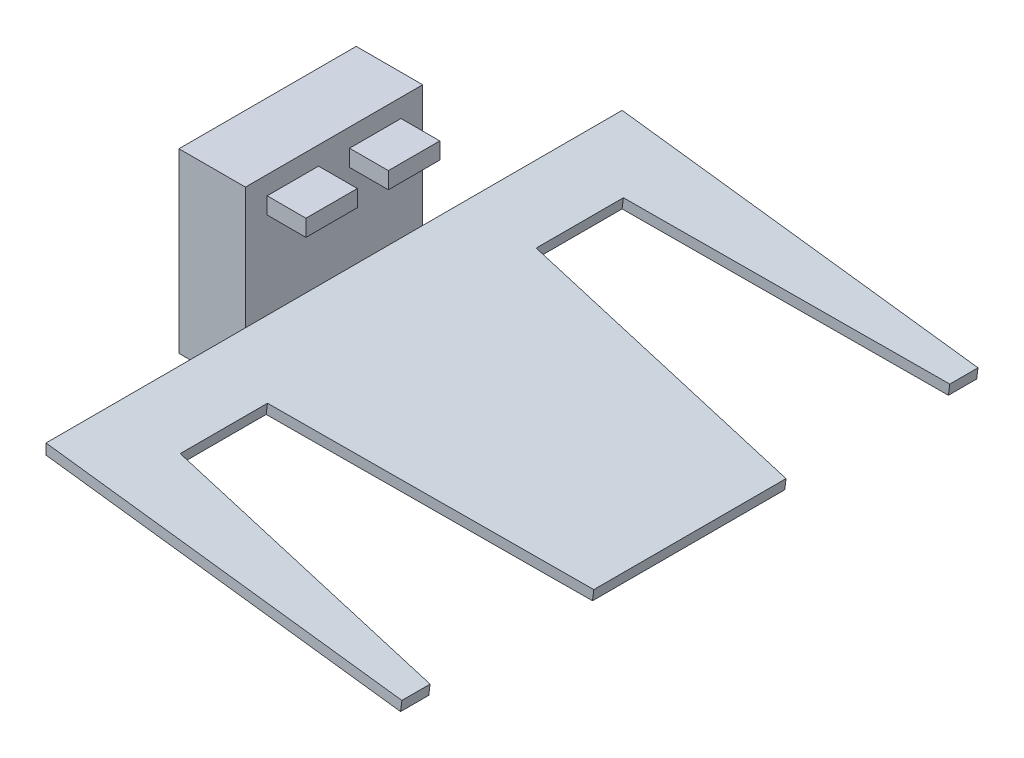
ISO-10303-21;
HEADER;
FILE_DESCRIPTION(('STEP AP214'),'2;1');
FILE_NAME('part.step','',(''),(''),'','','');
FILE_SCHEMA(('AUTOMOTIVE_DESIGN { 1 0 10303 214 1 1 1 1 }'));
ENDSEC;
DATA;
#1=APPLICATION_CONTEXT('core data for automotive mechanical design processes');
#2=APPLICATION_PROTOCOL_DEFINITION('international standard','automotive_design',2000,#1);
#3=PRODUCT_CONTEXT('',#1,'mechanical');
#4=PRODUCT('Part','Part','',(#3));
#5=PRODUCT_RELATED_PRODUCT_CATEGORY('part','',(#4));
#6=PRODUCT_DEFINITION_FORMATION('','',#4);
#7=PRODUCT_DEFINITION_CONTEXT('part definition',#1,'design');
#8=PRODUCT_DEFINITION('design','',#6,#7);
#9=PRODUCT_DEFINITION_SHAPE('','',#8);
#10=(LENGTH_UNIT() NAMED_UNIT(*) SI_UNIT(.MILLI.,.METRE.));
#11=(NAMED_UNIT(*) PLANE_ANGLE_UNIT() SI_UNIT($,.RADIAN.));
#12=(NAMED_UNIT(*) SI_UNIT($,.STERADIAN.) SOLID_ANGLE_UNIT());
#13=UNCERTAINTY_MEASURE_WITH_UNIT(LENGTH_MEASURE(1.E-05),#10,'distance_accuracy_value','');
#14=(GEOMETRIC_REPRESENTATION_CONTEXT(3) GLOBAL_UNCERTAINTY_ASSIGNED_CONTEXT((#13)) GLOBAL_UNIT_ASSIGNED_CONTEXT((#10,
#11,#12)) REPRESENTATION_CONTEXT('',''));
#15=CARTESIAN_POINT('',(0.,0.,0.));
#16=DIRECTION('',(0.,0.,1.));
#17=DIRECTION('',(1.,0.,0.));
#18=AXIS2_PLACEMENT_3D('',#15,#16,#17);
#19=CARTESIAN_POINT('',(20.6375,45.5277500044092,-19.177));
#20=DIRECTION('',(0.,-1.,0.));
#21=DIRECTION('',(0.,0.,-1.));
#22=AXIS2_PLACEMENT_3D('',#19,#20,#21);
#23=PLANE('',#22);
#24=DIRECTION('',(0.,0.,1.));
#25=VECTOR('',#24,1.);
#26=CARTESIAN_POINT('',(9.525,45.5277500044092,-19.177));
#27=LINE('',#26,#25);
#28=CARTESIAN_POINT('',(9.525,45.5277500044092,-19.177));
#29=VERTEX_POINT('',#28);
#30=CARTESIAN_POINT('',(9.525,45.5277500044092,-4.445));
#31=VERTEX_POINT('',#30);
#32=EDGE_CURVE('E105',#29,#31,#27,.T.);
#33=ORIENTED_EDGE('',*,*,#32,.T.);
#34=DIRECTION('',(-1.,0.,0.));
#35=VECTOR('',#34,1.);
#36=CARTESIAN_POINT('',(20.6375,45.5277500044092,-4.445));
#37=LINE('',#36,#35);
#38=CARTESIAN_POINT('',(20.6375,45.5277500044092,-4.445));
#39=VERTEX_POINT('',#38);
#40=EDGE_CURVE('E12',#39,#31,#37,.T.);
#41=ORIENTED_EDGE('',*,*,#40,.F.);
#42=DIRECTION('',(0.,0.,1.));
#43=VECTOR('',#42,1.);
#44=CARTESIAN_POINT('',(20.6375,45.5277500044092,-19.177));
#45=LINE('',#44,#43);
#46=CARTESIAN_POINT('',(20.6375,45.5277500044092,-19.177));
#47=VERTEX_POINT('',#46);
#48=EDGE_CURVE('E93',#47,#39,#45,.T.);
#49=ORIENTED_EDGE('',*,*,#48,.F.);
#50=DIRECTION('',(-1.,0.,0.));
#51=VECTOR('',#50,1.);
#52=CARTESIAN_POINT('',(20.6375,45.5277500044092,-19.177));
#53=LINE('',#52,#51);
#54=EDGE_CURVE('E101',#47,#29,#53,.T.);
#55=ORIENTED_EDGE('',*,*,#54,.T.);
#56=EDGE_LOOP('',(#33,#41,#49,#55));
#57=FACE_BOUND('',#56,.T.);
#58=ADVANCED_FACE('F42',(#57),#23,.F.);
#59=CARTESIAN_POINT('',(20.6375,45.5277500044092,-4.445));
#60=DIRECTION('',(0.,0.,-1.));
#61=DIRECTION('',(0.,1.,0.));
#62=AXIS2_PLACEMENT_3D('',#59,#60,#61);
#63=PLANE('',#62);
#64=DIRECTION('',(0.,-1.,0.));
#65=VECTOR('',#64,1.);
#66=CARTESIAN_POINT('',(9.525,45.5277500044092,-4.445));
#67=LINE('',#66,#65);
#68=CARTESIAN_POINT('',(9.525,40.7652500044092,-4.445));
#69=VERTEX_POINT('',#68);
#70=EDGE_CURVE('E97',#31,#69,#67,.T.);
#71=ORIENTED_EDGE('',*,*,#70,.T.);
#72=DIRECTION('',(-1.,0.,0.));
#73=VECTOR('',#72,1.);
#74=CARTESIAN_POINT('',(20.6375,40.7652500044092,-4.445));
#75=LINE('',#74,#73);
#76=CARTESIAN_POINT('',(20.6375,40.7652500044092,-4.445));
#77=VERTEX_POINT('',#76);
#78=EDGE_CURVE('E50',#77,#69,#75,.T.);
#79=ORIENTED_EDGE('',*,*,#78,.F.);
#80=DIRECTION('',(0.,-1.,0.));
#81=VECTOR('',#80,1.);
#82=CARTESIAN_POINT('',(20.6375,45.5277500044092,-4.445));
#83=LINE('',#82,#81);
#84=EDGE_CURVE('E88',#39,#77,#83,.T.);
#85=ORIENTED_EDGE('',*,*,#84,.F.);
#86=ORIENTED_EDGE('',*,*,#40,.T.);
#87=EDGE_LOOP('',(#71,#79,#85,#86));
#88=FACE_BOUND('',#87,.T.);
#89=ADVANCED_FACE('F96',(#88),#63,.F.);
#90=CARTESIAN_POINT('',(20.6375,40.7652500044092,-19.177));
#91=DIRECTION('',(0.,1.,0.));
#92=DIRECTION('',(0.,0.,1.));
#93=AXIS2_PLACEMENT_3D('',#90,#91,#92);
#94=PLANE('',#93);
#95=DIRECTION('',(0.,0.,-1.));
#96=VECTOR('',#95,1.);
#97=CARTESIAN_POINT('',(9.525,40.7652500044092,-19.177));
#98=LINE('',#97,#96);
#99=CARTESIAN_POINT('',(9.525,40.7652500044092,-19.177));
#100=VERTEX_POINT('',#99);
#101=EDGE_CURVE('E75',#69,#100,#98,.T.);
#102=ORIENTED_EDGE('',*,*,#101,.T.);
#103=DIRECTION('',(-1.,0.,0.));
#104=VECTOR('',#103,1.);
#105=CARTESIAN_POINT('',(20.6375,40.7652500044092,-19.177));
#106=LINE('',#105,#104);
#107=CARTESIAN_POINT('',(20.6375,40.7652500044092,-19.177));
#108=VERTEX_POINT('',#107);
#109=EDGE_CURVE('E98',#108,#100,#106,.T.);
#110=ORIENTED_EDGE('',*,*,#109,.F.);
#111=DIRECTION('',(0.,0.,-1.));
#112=VECTOR('',#111,1.);
#113=CARTESIAN_POINT('',(20.6375,40.7652500044092,-19.177));
#114=LINE('',#113,#112);
#115=EDGE_CURVE('E91',#77,#108,#114,.T.);
#116=ORIENTED_EDGE('',*,*,#115,.F.);
#117=ORIENTED_EDGE('',*,*,#78,.T.);
#118=EDGE_LOOP('',(#102,#110,#116,#117));
#119=FACE_BOUND('',#118,.T.);
#120=ADVANCED_FACE('F99',(#119),#94,.F.);
#121=CARTESIAN_POINT('',(20.6375,45.5277500044092,-19.177));
#122=DIRECTION('',(0.,0.,1.));
#123=DIRECTION('',(1.,0.,0.));
#124=AXIS2_PLACEMENT_3D('',#121,#122,#123);
#125=PLANE('',#124);
#126=DIRECTION('',(0.,1.,0.));
#127=VECTOR('',#126,1.);
#128=CARTESIAN_POINT('',(9.525,45.5277500044092,-19.177));
#129=LINE('',#128,#127);
#130=EDGE_CURVE('E81',#100,#29,#129,.T.);
#131=ORIENTED_EDGE('',*,*,#130,.T.);
#132=ORIENTED_EDGE('',*,*,#54,.F.);
#133=DIRECTION('',(0.,1.,0.));
#134=VECTOR('',#133,1.);
#135=CARTESIAN_POINT('',(20.6375,45.5277500044092,-19.177));
#136=LINE('',#135,#134);
#137=EDGE_CURVE('E58',#108,#47,#136,.T.);
#138=ORIENTED_EDGE('',*,*,#137,.F.);
#139=ORIENTED_EDGE('',*,*,#109,.T.);
#140=EDGE_LOOP('',(#131,#132,#138,#139));
#141=FACE_BOUND('',#140,.T.);
#142=ADVANCED_FACE('F112',(#141),#125,.F.);
#143=CARTESIAN_POINT('',(20.6375,45.5277500044092,-4.445));
#144=DIRECTION('',(1.,0.,0.));
#145=DIRECTION('',(0.,0.,-1.));
#146=AXIS2_PLACEMENT_3D('',#143,#144,#145);
#147=PLANE('',#146);
#148=ORIENTED_EDGE('',*,*,#48,.T.);
#149=ORIENTED_EDGE('',*,*,#84,.T.);
#150=ORIENTED_EDGE('',*,*,#115,.T.);
#151=ORIENTED_EDGE('',*,*,#137,.T.);
#152=EDGE_LOOP('',(#148,#149,#150,#151));
#153=FACE_BOUND('',#152,.T.);
#154=ADVANCED_FACE('F89',(#153),#147,.T.);
#155=CARTESIAN_POINT('',(9.525,45.5277500044092,-4.445));
#156=DIRECTION('',(1.,0.,0.));
#157=DIRECTION('',(0.,0.,-1.));
#158=AXIS2_PLACEMENT_3D('',#155,#156,#157);
#159=PLANE('',#158);
#160=ORIENTED_EDGE('',*,*,#32,.F.);
#161=ORIENTED_EDGE('',*,*,#130,.F.);
#162=ORIENTED_EDGE('',*,*,#101,.F.);
#163=ORIENTED_EDGE('',*,*,#70,.F.);
#164=EDGE_LOOP('',(#160,#161,#162,#163));
#165=FACE_BOUND('',#164,.T.);
#166=ADVANCED_FACE('F115',(#165),#159,.F.);
#167=CLOSED_SHELL('',(#58,#89,#120,#142,#154,#166));
#168=MANIFOLD_SOLID_BREP('B2',#167);
#169=CARTESIAN_POINT('',(20.6375,45.5277500044092,19.177));
#170=DIRECTION('',(0.,0.,-1.));
#171=DIRECTION('',(-1.,0.,0.));
#172=AXIS2_PLACEMENT_3D('',#169,#170,#171);
#173=PLANE('',#172);
#174=DIRECTION('',(0.,-1.,0.));
#175=VECTOR('',#174,1.);
#176=CARTESIAN_POINT('',(9.525,45.5277500044092,19.177));
#177=LINE('',#176,#175);
#178=CARTESIAN_POINT('',(9.525,45.5277500044092,19.177));
#179=VERTEX_POINT('',#178);
#180=CARTESIAN_POINT('',(9.525,40.7652500044092,19.177));
#181=VERTEX_POINT('',#180);
#182=EDGE_CURVE('E239',#179,#181,#177,.T.);
#183=ORIENTED_EDGE('',*,*,#182,.T.);
#184=DIRECTION('',(-1.,0.,0.));
#185=VECTOR('',#184,1.);
#186=CARTESIAN_POINT('',(20.6375,40.7652500044092,19.177));
#187=LINE('',#186,#185);
#188=CARTESIAN_POINT('',(20.6375,40.7652500044092,19.177));
#189=VERTEX_POINT('',#188);
#190=EDGE_CURVE('E40',#189,#181,#187,.T.);
#191=ORIENTED_EDGE('',*,*,#190,.F.);
#192=DIRECTION('',(0.,-1.,0.));
#193=VECTOR('',#192,1.);
#194=CARTESIAN_POINT('',(20.6375,45.5277500044092,19.177));
#195=LINE('',#194,#193);
#196=CARTESIAN_POINT('',(20.6375,45.5277500044092,19.177));
#197=VERTEX_POINT('',#196);
#198=EDGE_CURVE('E227',#197,#189,#195,.T.);
#199=ORIENTED_EDGE('',*,*,#198,.F.);
#200=DIRECTION('',(-1.,0.,0.));
#201=VECTOR('',#200,1.);
#202=CARTESIAN_POINT('',(20.6375,45.5277500044092,19.177));
#203=LINE('',#202,#201);
#204=EDGE_CURVE('E235',#197,#179,#203,.T.);
#205=ORIENTED_EDGE('',*,*,#204,.T.);
#206=EDGE_LOOP('',(#183,#191,#199,#205));
#207=FACE_BOUND('',#206,.T.);
#208=ADVANCED_FACE('F176',(#207),#173,.F.);
#209=CARTESIAN_POINT('',(20.6375,40.7652500044092,19.177));
#210=DIRECTION('',(0.,1.,0.));
#211=DIRECTION('',(-1.,0.,0.));
#212=AXIS2_PLACEMENT_3D('',#209,#210,#211);
#213=PLANE('',#212);
#214=DIRECTION('',(0.,0.,-1.));
#215=VECTOR('',#214,1.);
#216=CARTESIAN_POINT('',(9.525,40.7652500044092,19.177));
#217=LINE('',#216,#215);
#218=CARTESIAN_POINT('',(9.525,40.7652500044092,4.445));
#219=VERTEX_POINT('',#218);
#220=EDGE_CURVE('E231',#181,#219,#217,.T.);
#221=ORIENTED_EDGE('',*,*,#220,.T.);
#222=DIRECTION('',(-1.,0.,0.));
#223=VECTOR('',#222,1.);
#224=CARTESIAN_POINT('',(20.6375,40.7652500044092,4.445));
#225=LINE('',#224,#223);
#226=CARTESIAN_POINT('',(20.6375,40.7652500044092,4.445));
#227=VERTEX_POINT('',#226);
#228=EDGE_CURVE('E184',#227,#219,#225,.T.);
#229=ORIENTED_EDGE('',*,*,#228,.F.);
#230=DIRECTION('',(0.,0.,-1.));
#231=VECTOR('',#230,1.);
#232=CARTESIAN_POINT('',(20.6375,40.7652500044092,19.177));
#233=LINE('',#232,#231);
#234=EDGE_CURVE('E222',#189,#227,#233,.T.);
#235=ORIENTED_EDGE('',*,*,#234,.F.);
#236=ORIENTED_EDGE('',*,*,#190,.T.);
#237=EDGE_LOOP('',(#221,#229,#235,#236));
#238=FACE_BOUND('',#237,.T.);
#239=ADVANCED_FACE('F230',(#238),#213,.F.);
#240=CARTESIAN_POINT('',(20.6375,45.5277500044092,4.445));
#241=DIRECTION('',(0.,0.,1.));
#242=DIRECTION('',(0.,-1.,0.));
#243=AXIS2_PLACEMENT_3D('',#240,#241,#242);
#244=PLANE('',#243);
#245=DIRECTION('',(0.,1.,0.));
#246=VECTOR('',#245,1.);
#247=CARTESIAN_POINT('',(9.525,45.5277500044092,4.445));
#248=LINE('',#247,#246);
#249=CARTESIAN_POINT('',(9.525,45.5277500044092,4.445));
#250=VERTEX_POINT('',#249);
#251=EDGE_CURVE('E209',#219,#250,#248,.T.);
#252=ORIENTED_EDGE('',*,*,#251,.T.);
#253=DIRECTION('',(-1.,0.,0.));
#254=VECTOR('',#253,1.);
#255=CARTESIAN_POINT('',(20.6375,45.5277500044092,4.445));
#256=LINE('',#255,#254);
#257=CARTESIAN_POINT('',(20.6375,45.5277500044092,4.445));
#258=VERTEX_POINT('',#257);
#259=EDGE_CURVE('E232',#258,#250,#256,.T.);
#260=ORIENTED_EDGE('',*,*,#259,.F.);
#261=DIRECTION('',(0.,1.,0.));
#262=VECTOR('',#261,1.);
#263=CARTESIAN_POINT('',(20.6375,45.5277500044092,4.445));
#264=LINE('',#263,#262);
#265=EDGE_CURVE('E225',#227,#258,#264,.T.);
#266=ORIENTED_EDGE('',*,*,#265,.F.);
#267=ORIENTED_EDGE('',*,*,#228,.T.);
#268=EDGE_LOOP('',(#252,#260,#266,#267));
#269=FACE_BOUND('',#268,.T.);
#270=ADVANCED_FACE('F233',(#269),#244,.F.);
#271=CARTESIAN_POINT('',(20.6375,45.5277500044092,19.177));
#272=DIRECTION('',(0.,-1.,0.));
#273=DIRECTION('',(1.,0.,0.));
#274=AXIS2_PLACEMENT_3D('',#271,#272,#273);
#275=PLANE('',#274);
#276=DIRECTION('',(0.,0.,1.));
#277=VECTOR('',#276,1.);
#278=CARTESIAN_POINT('',(9.525,45.5277500044092,19.177));
#279=LINE('',#278,#277);
#280=EDGE_CURVE('E215',#250,#179,#279,.T.);
#281=ORIENTED_EDGE('',*,*,#280,.T.);
#282=ORIENTED_EDGE('',*,*,#204,.F.);
#283=DIRECTION('',(0.,0.,1.));
#284=VECTOR('',#283,1.);
#285=CARTESIAN_POINT('',(20.6375,45.5277500044092,19.177));
#286=LINE('',#285,#284);
#287=EDGE_CURVE('E192',#258,#197,#286,.T.);
#288=ORIENTED_EDGE('',*,*,#287,.F.);
#289=ORIENTED_EDGE('',*,*,#259,.T.);
#290=EDGE_LOOP('',(#281,#282,#288,#289));
#291=FACE_BOUND('',#290,.T.);
#292=ADVANCED_FACE('F246',(#291),#275,.F.);
#293=CARTESIAN_POINT('',(20.6375,40.7652500044092,19.177));
#294=DIRECTION('',(1.,0.,0.));
#295=DIRECTION('',(0.,0.,-1.));
#296=AXIS2_PLACEMENT_3D('',#293,#294,#295);
#297=PLANE('',#296);
#298=ORIENTED_EDGE('',*,*,#198,.T.);
#299=ORIENTED_EDGE('',*,*,#234,.T.);
#300=ORIENTED_EDGE('',*,*,#265,.T.);
#301=ORIENTED_EDGE('',*,*,#287,.T.);
#302=EDGE_LOOP('',(#298,#299,#300,#301));
#303=FACE_BOUND('',#302,.T.);
#304=ADVANCED_FACE('F223',(#303),#297,.T.);
#305=CARTESIAN_POINT('',(9.525,40.7652500044092,19.177));
#306=DIRECTION('',(1.,0.,0.));
#307=DIRECTION('',(0.,0.,-1.));
#308=AXIS2_PLACEMENT_3D('',#305,#306,#307);
#309=PLANE('',#308);
#310=ORIENTED_EDGE('',*,*,#182,.F.);
#311=ORIENTED_EDGE('',*,*,#280,.F.);
#312=ORIENTED_EDGE('',*,*,#251,.F.);
#313=ORIENTED_EDGE('',*,*,#220,.F.);
#314=EDGE_LOOP('',(#310,#311,#312,#313));
#315=FACE_BOUND('',#314,.T.);
#316=ADVANCED_FACE('F249',(#315),#309,.F.);
#317=CLOSED_SHELL('',(#208,#239,#270,#292,#304,#316));
#318=MANIFOLD_SOLID_BREP('B6',#317);
#319=CARTESIAN_POINT('',(111.125,0.,82.55));
#320=DIRECTION('',(-0.992091804885704,0.125514344513393,0.));
#321=DIRECTION('',(-0.125514344513393,-0.992091804885704,0.));
#322=AXIS2_PLACEMENT_3D('',#319,#320,#321);
#323=PLANE('',#322);
#324=DIRECTION('',(0.,0.,-1.));
#325=VECTOR('',#324,1.);
#326=CARTESIAN_POINT('',(111.501191593376,2.97349755760343,82.55));
#327=LINE('',#326,#325);
#328=CARTESIAN_POINT('',(111.501191593376,2.97349755760344,27.543705698838));
#329=VERTEX_POINT('',#328);
#330=CARTESIAN_POINT('',(111.501191593376,2.97349755760344,-27.543705698838));
#331=VERTEX_POINT('',#330);
#332=EDGE_CURVE('E487',#329,#331,#327,.T.);
#333=ORIENTED_EDGE('',*,*,#332,.F.);
#334=DIRECTION('',(0.125514344513391,0.992091804885704,0.));
#335=VECTOR('',#334,1.);
#336=CARTESIAN_POINT('',(109.22415764002,-15.024658217564,27.543705698838));
#337=LINE('',#336,#335);
#338=CARTESIAN_POINT('',(111.125,0.,27.543705698838));
#339=VERTEX_POINT('',#338);
#340=EDGE_CURVE('E438',#339,#329,#337,.T.);
#341=ORIENTED_EDGE('',*,*,#340,.F.);
#342=DIRECTION('',(0.,0.,-1.));
#343=VECTOR('',#342,1.);
#344=CARTESIAN_POINT('',(111.125,0.,82.55));
#345=LINE('',#344,#343);
#346=CARTESIAN_POINT('',(111.125,0.,-27.543705698838));
#347=VERTEX_POINT('',#346);
#348=EDGE_CURVE('E488',#339,#347,#345,.T.);
#349=ORIENTED_EDGE('',*,*,#348,.T.);
#350=DIRECTION('',(0.125514344513391,0.992091804885704,0.));
#351=VECTOR('',#350,1.);
#352=CARTESIAN_POINT('',(109.22415764002,-15.024658217564,-27.543705698838));
#353=LINE('',#352,#351);
#354=EDGE_CURVE('E457',#347,#331,#353,.T.);
#355=ORIENTED_EDGE('',*,*,#354,.T.);
#356=EDGE_LOOP('',(#333,#341,#349,#355));
#357=FACE_BOUND('',#356,.T.);
#358=ADVANCED_FACE('F309',(#357),#323,.F.);
#359=CARTESIAN_POINT('',(111.501191593376,2.97349755760344,-74.456294301162));
#360=VERTEX_POINT('',#359);
#361=CARTESIAN_POINT('',(111.501191593376,2.97349755760343,-82.55));
#362=VERTEX_POINT('',#361);
#363=EDGE_CURVE('E344',#360,#362,#327,.T.);
#364=ORIENTED_EDGE('',*,*,#363,.F.);
#365=DIRECTION('',(0.125514344513391,0.992091804885704,0.));
#366=VECTOR('',#365,1.);
#367=CARTESIAN_POINT('',(109.22415764002,-15.024658217564,-74.456294301162));
#368=LINE('',#367,#366);
#369=CARTESIAN_POINT('',(111.125,0.,-74.456294301162));
#370=VERTEX_POINT('',#369);
#371=EDGE_CURVE('E455',#370,#360,#368,.T.);
#372=ORIENTED_EDGE('',*,*,#371,.F.);
#373=CARTESIAN_POINT('',(111.125,0.,-82.55));
#374=VERTEX_POINT('',#373);
#375=EDGE_CURVE('E486',#370,#374,#345,.T.);
#376=ORIENTED_EDGE('',*,*,#375,.T.);
#377=DIRECTION('',(0.125514344513393,0.992091804885704,0.));
#378=VECTOR('',#377,1.);
#379=CARTESIAN_POINT('',(111.125,0.,-82.55));
#380=LINE('',#379,#378);
#381=EDGE_CURVE('E480',#374,#362,#380,.T.);
#382=ORIENTED_EDGE('',*,*,#381,.T.);
#383=EDGE_LOOP('',(#364,#372,#376,#382));
#384=FACE_BOUND('',#383,.T.);
#385=ADVANCED_FACE('F494',(#384),#323,.F.);
#386=CARTESIAN_POINT('',(9.525,12.8539086199081,82.55));
#387=DIRECTION('',(0.125514344513391,0.992091804885704,0.));
#388=DIRECTION('',(-0.992091804885704,0.125514344513391,0.));
#389=AXIS2_PLACEMENT_3D('',#386,#387,#388);
#390=PLANE('',#389);
#391=ORIENTED_EDGE('',*,*,#348,.F.);
#392=DIRECTION('',(0.983604321965001,-0.124440551896504,-0.130526192220045));
#393=VECTOR('',#392,1.);
#394=CARTESIAN_POINT('',(28.5618129181628,10.4454691153377,38.5));
#395=LINE('',#394,#393);
#396=CARTESIAN_POINT('',(28.5618129181628,10.4454691153377,38.5));
#397=VERTEX_POINT('',#396);
#398=EDGE_CURVE('E430',#397,#339,#395,.T.);
#399=ORIENTED_EDGE('',*,*,#398,.F.);
#400=DIRECTION('',(0.,0.,-1.));
#401=VECTOR('',#400,1.);
#402=CARTESIAN_POINT('',(28.5618129181628,10.4454691153377,38.5));
#403=LINE('',#402,#401);
#404=CARTESIAN_POINT('',(28.5618129181628,10.4454691153377,63.5));
#405=VERTEX_POINT('',#404);
#406=EDGE_CURVE('E411',#405,#397,#403,.T.);
#407=ORIENTED_EDGE('',*,*,#406,.F.);
#408=DIRECTION('',(-0.983604321965001,0.124440551896504,-0.130526192220045));
#409=VECTOR('',#408,1.);
#410=CARTESIAN_POINT('',(28.5618129181628,10.4454691153377,63.5));
#411=LINE('',#410,#409);
#412=CARTESIAN_POINT('',(111.125,0.,74.456294301162));
#413=VERTEX_POINT('',#412);
#414=EDGE_CURVE('E421',#413,#405,#411,.T.);
#415=ORIENTED_EDGE('',*,*,#414,.F.);
#416=CARTESIAN_POINT('',(111.125,0.,82.55));
#417=VERTEX_POINT('',#416);
#418=EDGE_CURVE('E318',#417,#413,#345,.T.);
#419=ORIENTED_EDGE('',*,*,#418,.F.);
#420=DIRECTION('',(0.992091804885704,-0.125514344513391,0.));
#421=VECTOR('',#420,1.);
#422=CARTESIAN_POINT('',(9.525,12.8539086199081,82.55));
#423=LINE('',#422,#421);
#424=CARTESIAN_POINT('',(9.525,12.8539086199081,82.55));
#425=VERTEX_POINT('',#424);
#426=EDGE_CURVE('E355',#425,#417,#423,.T.);
#427=ORIENTED_EDGE('',*,*,#426,.F.);
#428=DIRECTION('',(0.,0.,-1.));
#429=VECTOR('',#428,1.);
#430=CARTESIAN_POINT('',(9.525,12.8539086199081,82.55));
#431=LINE('',#430,#429);
#432=CARTESIAN_POINT('',(9.525,12.8539086199081,-82.55));
#433=VERTEX_POINT('',#432);
#434=EDGE_CURVE('E174',#425,#433,#431,.T.);
#435=ORIENTED_EDGE('',*,*,#434,.T.);
#436=DIRECTION('',(0.992091804885704,-0.125514344513391,0.));
#437=VECTOR('',#436,1.);
#438=CARTESIAN_POINT('',(9.525,12.8539086199081,-82.55));
#439=LINE('',#438,#437);
#440=EDGE_CURVE('E477',#433,#374,#439,.T.);
#441=ORIENTED_EDGE('',*,*,#440,.T.);
#442=ORIENTED_EDGE('',*,*,#375,.F.);
#443=DIRECTION('',(0.983604321965001,-0.124440551896504,-0.130526192220045));
#444=VECTOR('',#443,1.);
#445=CARTESIAN_POINT('',(28.5618129181628,10.4454691153377,-63.5));
#446=LINE('',#445,#444);
#447=CARTESIAN_POINT('',(28.5618129181628,10.4454691153377,-63.5));
#448=VERTEX_POINT('',#447);
#449=EDGE_CURVE('E443',#448,#370,#446,.T.);
#450=ORIENTED_EDGE('',*,*,#449,.F.);
#451=DIRECTION('',(0.,0.,-1.));
#452=VECTOR('',#451,1.);
#453=CARTESIAN_POINT('',(28.5618129181628,10.4454691153377,-63.5));
#454=LINE('',#453,#452);
#455=CARTESIAN_POINT('',(28.5618129181628,10.4454691153377,-38.5));
#456=VERTEX_POINT('',#455);
#457=EDGE_CURVE('E425',#456,#448,#454,.T.);
#458=ORIENTED_EDGE('',*,*,#457,.F.);
#459=DIRECTION('',(-0.983604321965001,0.124440551896504,-0.130526192220045));
#460=VECTOR('',#459,1.);
#461=CARTESIAN_POINT('',(28.5618129181628,10.4454691153377,-38.5));
#462=LINE('',#461,#460);
#463=EDGE_CURVE('E454',#347,#456,#462,.T.);
#464=ORIENTED_EDGE('',*,*,#463,.F.);
#465=EDGE_LOOP('',(#391,#399,#407,#415,#419,#427,#435,#441,#442,#450,#458,#464));
#466=FACE_BOUND('',#465,.T.);
#467=ADVANCED_FACE('F429',(#466),#390,.F.);
#468=CARTESIAN_POINT('',(9.525,15.875,82.55));
#469=DIRECTION('',(-0.125514344513391,-0.992091804885704,0.));
#470=DIRECTION('',(0.992091804885704,-0.125514344513391,0.));
#471=AXIS2_PLACEMENT_3D('',#468,#469,#470);
#472=PLANE('',#471);
#473=DIRECTION('',(0.,0.,1.));
#474=VECTOR('',#473,1.);
#475=CARTESIAN_POINT('',(28.9380045115383,13.4189666729412,38.5));
#476=LINE('',#475,#474);
#477=CARTESIAN_POINT('',(28.9380045115383,13.4189666729412,38.5));
#478=VERTEX_POINT('',#477);
#479=CARTESIAN_POINT('',(28.9380045115383,13.4189666729412,63.5));
#480=VERTEX_POINT('',#479);
#481=EDGE_CURVE('E414',#478,#480,#476,.T.);
#482=ORIENTED_EDGE('',*,*,#481,.F.);
#483=DIRECTION('',(-0.983604321965001,0.124440551896504,0.130526192220045));
#484=VECTOR('',#483,1.);
#485=CARTESIAN_POINT('',(28.9380045115383,13.4189666729412,38.5));
#486=LINE('',#485,#484);
#487=EDGE_CURVE('E418',#329,#478,#486,.T.);
#488=ORIENTED_EDGE('',*,*,#487,.F.);
#489=ORIENTED_EDGE('',*,*,#332,.T.);
#490=DIRECTION('',(0.983604321965001,-0.124440551896504,0.130526192220045));
#491=VECTOR('',#490,1.);
#492=CARTESIAN_POINT('',(28.9380045115383,13.4189666729412,-38.5));
#493=LINE('',#492,#491);
#494=CARTESIAN_POINT('',(28.9380045115383,13.4189666729412,-38.5));
#495=VERTEX_POINT('',#494);
#496=EDGE_CURVE('E445',#495,#331,#493,.T.);
#497=ORIENTED_EDGE('',*,*,#496,.F.);
#498=DIRECTION('',(0.,0.,-1.));
#499=VECTOR('',#498,1.);
#500=CARTESIAN_POINT('',(28.9380045115383,13.4189666729412,-38.5));
#501=LINE('',#500,#499);
#502=CARTESIAN_POINT('',(28.9380045115383,13.4189666729412,-63.5));
#503=VERTEX_POINT('',#502);
#504=EDGE_CURVE('E463',#495,#503,#501,.T.);
#505=ORIENTED_EDGE('',*,*,#504,.T.);
#506=DIRECTION('',(-0.983604321965001,0.124440551896504,0.130526192220045));
#507=VECTOR('',#506,1.);
#508=CARTESIAN_POINT('',(28.9380045115383,13.4189666729412,-63.5));
#509=LINE('',#508,#507);
#510=EDGE_CURVE('E448',#360,#503,#509,.T.);
#511=ORIENTED_EDGE('',*,*,#510,.F.);
#512=ORIENTED_EDGE('',*,*,#363,.T.);
#513=DIRECTION('',(-0.992091804885704,0.125514344513391,0.));
#514=VECTOR('',#513,1.);
#515=CARTESIAN_POINT('',(9.525,15.875,-82.55));
#516=LINE('',#515,#514);
#517=CARTESIAN_POINT('',(9.525,15.875,-82.55));
#518=VERTEX_POINT('',#517);
#519=EDGE_CURVE('E348',#362,#518,#516,.T.);
#520=ORIENTED_EDGE('',*,*,#519,.T.);
#521=DIRECTION('',(0.,0.,-1.));
#522=VECTOR('',#521,1.);
#523=CARTESIAN_POINT('',(9.525,15.875,82.55));
#524=LINE('',#523,#522);
#525=CARTESIAN_POINT('',(9.525,15.875,82.55));
#526=VERTEX_POINT('',#525);
#527=EDGE_CURVE('E474',#526,#518,#524,.T.);
#528=ORIENTED_EDGE('',*,*,#527,.F.);
#529=DIRECTION('',(-0.992091804885704,0.125514344513391,0.));
#530=VECTOR('',#529,1.);
#531=CARTESIAN_POINT('',(9.525,15.875,82.55));
#532=LINE('',#531,#530);
#533=CARTESIAN_POINT('',(111.501191593376,2.97349755760343,82.55));
#534=VERTEX_POINT('',#533);
#535=EDGE_CURVE('E326',#534,#526,#532,.T.);
#536=ORIENTED_EDGE('',*,*,#535,.F.);
#537=CARTESIAN_POINT('',(111.501191593376,2.97349755760344,74.456294301162));
#538=VERTEX_POINT('',#537);
#539=EDGE_CURVE('E484',#534,#538,#327,.T.);
#540=ORIENTED_EDGE('',*,*,#539,.T.);
#541=DIRECTION('',(0.983604321965001,-0.124440551896504,0.130526192220045));
#542=VECTOR('',#541,1.);
#543=CARTESIAN_POINT('',(28.9380045115383,13.4189666729412,63.5));
#544=LINE('',#543,#542);
#545=EDGE_CURVE('E432',#480,#538,#544,.T.);
#546=ORIENTED_EDGE('',*,*,#545,.F.);
#547=EDGE_LOOP('',(#482,#488,#489,#497,#505,#511,#512,#520,#528,#536,#540,#546));
#548=FACE_BOUND('',#547,.T.);
#549=ADVANCED_FACE('F503',(#548),#472,.F.);
#550=CARTESIAN_POINT('',(9.525,15.875,82.55));
#551=DIRECTION('',(1.,0.,0.));
#552=DIRECTION('',(0.,0.,-1.));
#553=AXIS2_PLACEMENT_3D('',#550,#551,#552);
#554=PLANE('',#553);
#555=DIRECTION('',(0.,-1.,0.));
#556=VECTOR('',#555,1.);
#557=CARTESIAN_POINT('',(9.525,15.875,-82.55));
#558=LINE('',#557,#556);
#559=EDGE_CURVE('E467',#518,#433,#558,.T.);
#560=ORIENTED_EDGE('',*,*,#559,.T.);
#561=ORIENTED_EDGE('',*,*,#434,.F.);
#562=DIRECTION('',(0.,-1.,0.));
#563=VECTOR('',#562,1.);
#564=CARTESIAN_POINT('',(9.525,15.875,82.55));
#565=LINE('',#564,#563);
#566=EDGE_CURVE('E468',#526,#425,#565,.T.);
#567=ORIENTED_EDGE('',*,*,#566,.F.);
#568=ORIENTED_EDGE('',*,*,#527,.T.);
#569=EDGE_LOOP('',(#560,#561,#567,#568));
#570=FACE_BOUND('',#569,.T.);
#571=ADVANCED_FACE('F311',(#570),#554,.F.);
#572=ORIENTED_EDGE('',*,*,#418,.T.);
#573=DIRECTION('',(0.125514344513391,0.992091804885704,0.));
#574=VECTOR('',#573,1.);
#575=CARTESIAN_POINT('',(109.22415764002,-15.024658217564,74.456294301162));
#576=LINE('',#575,#574);
#577=EDGE_CURVE('E417',#413,#538,#576,.T.);
#578=ORIENTED_EDGE('',*,*,#577,.T.);
#579=ORIENTED_EDGE('',*,*,#539,.F.);
#580=DIRECTION('',(0.125514344513393,0.992091804885704,0.));
#581=VECTOR('',#580,1.);
#582=CARTESIAN_POINT('',(111.125,0.,82.55));
#583=LINE('',#582,#581);
#584=EDGE_CURVE('E471',#417,#534,#583,.T.);
#585=ORIENTED_EDGE('',*,*,#584,.F.);
#586=EDGE_LOOP('',(#572,#578,#579,#585));
#587=FACE_BOUND('',#586,.T.);
#588=ADVANCED_FACE('F505',(#587),#323,.F.);
#589=CARTESIAN_POINT('',(9.525,12.8539086199081,82.55));
#590=DIRECTION('',(0.,0.,1.));
#591=DIRECTION('',(1.,0.,0.));
#592=AXIS2_PLACEMENT_3D('',#589,#590,#591);
#593=PLANE('',#592);
#594=ORIENTED_EDGE('',*,*,#566,.T.);
#595=ORIENTED_EDGE('',*,*,#426,.T.);
#596=ORIENTED_EDGE('',*,*,#584,.T.);
#597=ORIENTED_EDGE('',*,*,#535,.T.);
#598=EDGE_LOOP('',(#594,#595,#596,#597));
#599=FACE_BOUND('',#598,.T.);
#600=ADVANCED_FACE('F506',(#599),#593,.T.);
#601=CARTESIAN_POINT('',(9.525,12.8539086199081,-82.55));
#602=DIRECTION('',(0.,0.,1.));
#603=DIRECTION('',(1.,0.,0.));
#604=AXIS2_PLACEMENT_3D('',#601,#602,#603);
#605=PLANE('',#604);
#606=ORIENTED_EDGE('',*,*,#559,.F.);
#607=ORIENTED_EDGE('',*,*,#519,.F.);
#608=ORIENTED_EDGE('',*,*,#381,.F.);
#609=ORIENTED_EDGE('',*,*,#440,.F.);
#610=EDGE_LOOP('',(#606,#607,#608,#609));
#611=FACE_BOUND('',#610,.T.);
#612=ADVANCED_FACE('F500',(#611),#605,.F.);
#613=CARTESIAN_POINT('',(26.6609705581832,-4.57918910222631,-63.5));
#614=DIRECTION('',(-0.992091804885704,0.125514344513391,0.));
#615=DIRECTION('',(-0.125514344513391,-0.992091804885704,0.));
#616=AXIS2_PLACEMENT_3D('',#613,#614,#615);
#617=PLANE('',#616);
#618=ORIENTED_EDGE('',*,*,#457,.T.);
#619=DIRECTION('',(0.125514344513391,0.992091804885704,0.));
#620=VECTOR('',#619,1.);
#621=CARTESIAN_POINT('',(26.6609705581832,-4.57918910222631,-63.5));
#622=LINE('',#621,#620);
#623=EDGE_CURVE('E452',#448,#503,#622,.T.);
#624=ORIENTED_EDGE('',*,*,#623,.T.);
#625=ORIENTED_EDGE('',*,*,#504,.F.);
#626=DIRECTION('',(0.125514344513391,0.992091804885704,0.));
#627=VECTOR('',#626,1.);
#628=CARTESIAN_POINT('',(26.6609705581832,-4.57918910222631,-38.5));
#629=LINE('',#628,#627);
#630=EDGE_CURVE('E451',#456,#495,#629,.T.);
#631=ORIENTED_EDGE('',*,*,#630,.F.);
#632=EDGE_LOOP('',(#618,#624,#625,#631));
#633=FACE_BOUND('',#632,.T.);
#634=ADVANCED_FACE('F513',(#633),#617,.F.);
#635=CARTESIAN_POINT('',(26.6609705581832,-4.57918910222631,-63.5));
#636=DIRECTION('',(-0.129493965624443,0.0163829094583279,-0.991444861373811));
#637=DIRECTION('',(-0.991577939925839,0.,0.129511347195636));
#638=AXIS2_PLACEMENT_3D('',#635,#636,#637);
#639=PLANE('',#638);
#640=ORIENTED_EDGE('',*,*,#449,.T.);
#641=ORIENTED_EDGE('',*,*,#371,.T.);
#642=ORIENTED_EDGE('',*,*,#510,.T.);
#643=ORIENTED_EDGE('',*,*,#623,.F.);
#644=EDGE_LOOP('',(#640,#641,#642,#643));
#645=FACE_BOUND('',#644,.T.);
#646=ADVANCED_FACE('F549',(#645),#639,.F.);
#647=CARTESIAN_POINT('',(26.6609705581832,-4.57918910222631,-38.5));
#648=DIRECTION('',(-0.129493965624443,0.0163829094583278,0.991444861373811));
#649=DIRECTION('',(0.991577939925839,0.,0.129511347195635));
#650=AXIS2_PLACEMENT_3D('',#647,#648,#649);
#651=PLANE('',#650);
#652=ORIENTED_EDGE('',*,*,#463,.T.);
#653=ORIENTED_EDGE('',*,*,#630,.T.);
#654=ORIENTED_EDGE('',*,*,#496,.T.);
#655=ORIENTED_EDGE('',*,*,#354,.F.);
#656=EDGE_LOOP('',(#652,#653,#654,#655));
#657=FACE_BOUND('',#656,.T.);
#658=ADVANCED_FACE('F559',(#657),#651,.F.);
#659=CARTESIAN_POINT('',(26.6609705581832,-4.57918910222631,38.5));
#660=DIRECTION('',(-0.992091804885704,0.125514344513391,0.));
#661=DIRECTION('',(-0.125514344513391,-0.992091804885704,0.));
#662=AXIS2_PLACEMENT_3D('',#659,#660,#661);
#663=PLANE('',#662);
#664=ORIENTED_EDGE('',*,*,#406,.T.);
#665=DIRECTION('',(0.125514344513391,0.992091804885704,0.));
#666=VECTOR('',#665,1.);
#667=CARTESIAN_POINT('',(26.6609705581832,-4.57918910222631,38.5));
#668=LINE('',#667,#666);
#669=EDGE_CURVE('E426',#397,#478,#668,.T.);
#670=ORIENTED_EDGE('',*,*,#669,.T.);
#671=ORIENTED_EDGE('',*,*,#481,.T.);
#672=DIRECTION('',(0.125514344513391,0.992091804885704,0.));
#673=VECTOR('',#672,1.);
#674=CARTESIAN_POINT('',(26.6609705581832,-4.57918910222631,63.5));
#675=LINE('',#674,#673);
#676=EDGE_CURVE('E406',#405,#480,#675,.T.);
#677=ORIENTED_EDGE('',*,*,#676,.F.);
#678=EDGE_LOOP('',(#664,#670,#671,#677));
#679=FACE_BOUND('',#678,.T.);
#680=ADVANCED_FACE('F408',(#679),#663,.F.);
#681=CARTESIAN_POINT('',(26.6609705581832,-4.57918910222631,38.5));
#682=DIRECTION('',(-0.129493965624443,0.0163829094583278,-0.991444861373811));
#683=DIRECTION('',(-0.991577939925839,0.,0.129511347195635));
#684=AXIS2_PLACEMENT_3D('',#681,#682,#683);
#685=PLANE('',#684);
#686=ORIENTED_EDGE('',*,*,#398,.T.);
#687=ORIENTED_EDGE('',*,*,#340,.T.);
#688=ORIENTED_EDGE('',*,*,#487,.T.);
#689=ORIENTED_EDGE('',*,*,#669,.F.);
#690=EDGE_LOOP('',(#686,#687,#688,#689));
#691=FACE_BOUND('',#690,.T.);
#692=ADVANCED_FACE('F578',(#691),#685,.F.);
#693=CARTESIAN_POINT('',(26.6609705581832,-4.57918910222631,63.5));
#694=DIRECTION('',(-0.129493965624443,0.0163829094583279,0.991444861373811));
#695=DIRECTION('',(0.991577939925839,0.,0.129511347195636));
#696=AXIS2_PLACEMENT_3D('',#693,#694,#695);
#697=PLANE('',#696);
#698=ORIENTED_EDGE('',*,*,#414,.T.);
#699=ORIENTED_EDGE('',*,*,#676,.T.);
#700=ORIENTED_EDGE('',*,*,#545,.T.);
#701=ORIENTED_EDGE('',*,*,#577,.F.);
#702=EDGE_LOOP('',(#698,#699,#700,#701));
#703=FACE_BOUND('',#702,.T.);
#704=ADVANCED_FACE('F422',(#703),#697,.F.);
#705=CLOSED_SHELL('',(#358,#385,#467,#549,#571,#588,#600,#612,#634,#646,#658,#680,#692,#704));
#706=MANIFOLD_SOLID_BREP('B34',#705);
#707=CARTESIAN_POINT('',(-9.525,0.,25.4));
#708=DIRECTION('',(0.,1.,0.));
#709=DIRECTION('',(0.,0.,1.));
#710=AXIS2_PLACEMENT_3D('',#707,#708,#709);
#711=PLANE('',#710);
#712=DIRECTION('',(1.,0.,0.));
#713=VECTOR('',#712,1.);
#714=CARTESIAN_POINT('',(-9.525,0.,-25.4));
#715=LINE('',#714,#713);
#716=CARTESIAN_POINT('',(-9.525,0.,-25.4));
#717=VERTEX_POINT('',#716);
#718=CARTESIAN_POINT('',(9.525,0.,-25.4));
#719=VERTEX_POINT('',#718);
#720=EDGE_CURVE('E680',#717,#719,#715,.T.);
#721=ORIENTED_EDGE('',*,*,#720,.T.);
#722=DIRECTION('',(0.,0.,-1.));
#723=VECTOR('',#722,1.);
#724=CARTESIAN_POINT('',(9.525,0.,25.4));
#725=LINE('',#724,#723);
#726=CARTESIAN_POINT('',(9.525,0.,25.4));
#727=VERTEX_POINT('',#726);
#728=EDGE_CURVE('E752',#727,#719,#725,.T.);
#729=ORIENTED_EDGE('',*,*,#728,.F.);
#730=DIRECTION('',(1.,0.,0.));
#731=VECTOR('',#730,1.);
#732=CARTESIAN_POINT('',(-9.525,0.,25.4));
#733=LINE('',#732,#731);
#734=CARTESIAN_POINT('',(-9.525,0.,25.4));
#735=VERTEX_POINT('',#734);
#736=EDGE_CURVE('E659',#735,#727,#733,.T.);
#737=ORIENTED_EDGE('',*,*,#736,.F.);
#738=DIRECTION('',(0.,0.,-1.));
#739=VECTOR('',#738,1.);
#740=CARTESIAN_POINT('',(-9.525,0.,25.4));
#741=LINE('',#740,#739);
#742=EDGE_CURVE('E762',#735,#717,#741,.T.);
#743=ORIENTED_EDGE('',*,*,#742,.T.);
#744=EDGE_LOOP('',(#721,#729,#737,#743));
#745=FACE_BOUND('',#744,.T.);
#746=DIRECTION('',(1.,0.,0.));
#747=VECTOR('',#746,1.);
#748=CARTESIAN_POINT('',(-9.525,0.,-23.8125));
#749=LINE('',#748,#747);
#750=CARTESIAN_POINT('',(-7.9375,0.,-23.8125));
#751=VERTEX_POINT('',#750);
#752=CARTESIAN_POINT('',(7.9375,0.,-23.8125));
#753=VERTEX_POINT('',#752);
#754=EDGE_CURVE('E733',#751,#753,#749,.T.);
#755=ORIENTED_EDGE('',*,*,#754,.F.);
#756=DIRECTION('',(0.,0.,-1.));
#757=VECTOR('',#756,1.);
#758=CARTESIAN_POINT('',(-7.9375,0.,25.4));
#759=LINE('',#758,#757);
#760=CARTESIAN_POINT('',(-7.9375,0.,23.8125));
#761=VERTEX_POINT('',#760);
#762=EDGE_CURVE('E728',#761,#751,#759,.T.);
#763=ORIENTED_EDGE('',*,*,#762,.F.);
#764=DIRECTION('',(1.,0.,0.));
#765=VECTOR('',#764,1.);
#766=CARTESIAN_POINT('',(-9.525,0.,23.8125));
#767=LINE('',#766,#765);
#768=CARTESIAN_POINT('',(7.9375,0.,23.8125));
#769=VERTEX_POINT('',#768);
#770=EDGE_CURVE('E650',#761,#769,#767,.T.);
#771=ORIENTED_EDGE('',*,*,#770,.T.);
#772=DIRECTION('',(0.,0.,-1.));
#773=VECTOR('',#772,1.);
#774=CARTESIAN_POINT('',(7.9375,0.,25.4));
#775=LINE('',#774,#773);
#776=EDGE_CURVE('E741',#769,#753,#775,.T.);
#777=ORIENTED_EDGE('',*,*,#776,.T.);
#778=EDGE_LOOP('',(#755,#763,#771,#777));
#779=FACE_BOUND('',#778,.T.);
#780=ADVANCED_FACE('F635',(#745,#779),#711,.F.);
#781=CARTESIAN_POINT('',(9.52500000000001,50.8,25.4));
#782=DIRECTION('',(-1.,0.,0.));
#783=DIRECTION('',(0.,-1.,0.));
#784=AXIS2_PLACEMENT_3D('',#781,#782,#783);
#785=PLANE('',#784);
#786=DIRECTION('',(0.,1.,0.));
#787=VECTOR('',#786,1.);
#788=CARTESIAN_POINT('',(9.52500000000001,50.8,-25.4));
#789=LINE('',#788,#787);
#790=CARTESIAN_POINT('',(9.52500000000001,50.8,-25.4));
#791=VERTEX_POINT('',#790);
#792=EDGE_CURVE('E753',#719,#791,#789,.T.);
#793=ORIENTED_EDGE('',*,*,#792,.T.);
#794=DIRECTION('',(0.,0.,-1.));
#795=VECTOR('',#794,1.);
#796=CARTESIAN_POINT('',(9.52500000000001,50.8,25.4));
#797=LINE('',#796,#795);
#798=CARTESIAN_POINT('',(9.52500000000001,50.8,25.4));
#799=VERTEX_POINT('',#798);
#800=EDGE_CURVE('E307',#799,#791,#797,.T.);
#801=ORIENTED_EDGE('',*,*,#800,.F.);
#802=DIRECTION('',(0.,1.,0.));
#803=VECTOR('',#802,1.);
#804=CARTESIAN_POINT('',(9.52500000000001,50.8,25.4));
#805=LINE('',#804,#803);
#806=EDGE_CURVE('E746',#727,#799,#805,.T.);
#807=ORIENTED_EDGE('',*,*,#806,.F.);
#808=ORIENTED_EDGE('',*,*,#728,.T.);
#809=EDGE_LOOP('',(#793,#801,#807,#808));
#810=FACE_BOUND('',#809,.T.);
#811=ADVANCED_FACE('F637',(#810),#785,.F.);
#812=CARTESIAN_POINT('',(-9.52500000000001,50.8,25.4));
#813=DIRECTION('',(0.,-1.,0.));
#814=DIRECTION('',(0.,0.,-1.));
#815=AXIS2_PLACEMENT_3D('',#812,#813,#814);
#816=PLANE('',#815);
#817=DIRECTION('',(-1.,0.,0.));
#818=VECTOR('',#817,1.);
#819=CARTESIAN_POINT('',(-9.52500000000001,50.8,-25.4));
#820=LINE('',#819,#818);
#821=CARTESIAN_POINT('',(-9.52500000000001,50.8,-25.4));
#822=VERTEX_POINT('',#821);
#823=EDGE_CURVE('E756',#791,#822,#820,.T.);
#824=ORIENTED_EDGE('',*,*,#823,.T.);
#825=DIRECTION('',(0.,0.,-1.));
#826=VECTOR('',#825,1.);
#827=CARTESIAN_POINT('',(-9.52500000000001,50.8,25.4));
#828=LINE('',#827,#826);
#829=CARTESIAN_POINT('',(-9.52500000000001,50.8,25.4));
#830=VERTEX_POINT('',#829);
#831=EDGE_CURVE('E643',#830,#822,#828,.T.);
#832=ORIENTED_EDGE('',*,*,#831,.F.);
#833=DIRECTION('',(-1.,0.,0.));
#834=VECTOR('',#833,1.);
#835=CARTESIAN_POINT('',(-9.52500000000001,50.8,25.4));
#836=LINE('',#835,#834);
#837=EDGE_CURVE('E687',#799,#830,#836,.T.);
#838=ORIENTED_EDGE('',*,*,#837,.F.);
#839=ORIENTED_EDGE('',*,*,#800,.T.);
#840=EDGE_LOOP('',(#824,#832,#838,#839));
#841=FACE_BOUND('',#840,.T.);
#842=ADVANCED_FACE('F801',(#841),#816,.F.);
#843=CARTESIAN_POINT('',(-9.52500000000001,50.8,25.4));
#844=DIRECTION('',(1.,0.,0.));
#845=DIRECTION('',(0.,1.,0.));
#846=AXIS2_PLACEMENT_3D('',#843,#844,#845);
#847=PLANE('',#846);
#848=DIRECTION('',(0.,-1.,0.));
#849=VECTOR('',#848,1.);
#850=CARTESIAN_POINT('',(-9.52500000000001,50.8,-25.4));
#851=LINE('',#850,#849);
#852=EDGE_CURVE('E758',#822,#717,#851,.T.);
#853=ORIENTED_EDGE('',*,*,#852,.T.);
#854=ORIENTED_EDGE('',*,*,#742,.F.);
#855=DIRECTION('',(0.,-1.,0.));
#856=VECTOR('',#855,1.);
#857=CARTESIAN_POINT('',(-9.52500000000001,50.8,25.4));
#858=LINE('',#857,#856);
#859=EDGE_CURVE('E749',#830,#735,#858,.T.);
#860=ORIENTED_EDGE('',*,*,#859,.F.);
#861=ORIENTED_EDGE('',*,*,#831,.T.);
#862=EDGE_LOOP('',(#853,#854,#860,#861));
#863=FACE_BOUND('',#862,.T.);
#864=ADVANCED_FACE('F767',(#863),#847,.F.);
#865=CARTESIAN_POINT('',(9.525,0.,25.4));
#866=DIRECTION('',(0.,0.,1.));
#867=DIRECTION('',(1.,0.,0.));
#868=AXIS2_PLACEMENT_3D('',#865,#866,#867);
#869=PLANE('',#868);
#870=ORIENTED_EDGE('',*,*,#806,.T.);
#871=ORIENTED_EDGE('',*,*,#837,.T.);
#872=ORIENTED_EDGE('',*,*,#859,.T.);
#873=ORIENTED_EDGE('',*,*,#736,.T.);
#874=EDGE_LOOP('',(#870,#871,#872,#873));
#875=FACE_BOUND('',#874,.T.);
#876=ADVANCED_FACE('F795',(#875),#869,.T.);
#877=CARTESIAN_POINT('',(9.525,0.,-25.4));
#878=DIRECTION('',(0.,0.,1.));
#879=DIRECTION('',(1.,0.,0.));
#880=AXIS2_PLACEMENT_3D('',#877,#878,#879);
#881=PLANE('',#880);
#882=ORIENTED_EDGE('',*,*,#792,.F.);
#883=ORIENTED_EDGE('',*,*,#720,.F.);
#884=ORIENTED_EDGE('',*,*,#852,.F.);
#885=ORIENTED_EDGE('',*,*,#823,.F.);
#886=EDGE_LOOP('',(#882,#883,#884,#885));
#887=FACE_BOUND('',#886,.T.);
#888=ADVANCED_FACE('F771',(#887),#881,.F.);
#889=CARTESIAN_POINT('',(7.93750000000001,50.8,25.4));
#890=DIRECTION('',(-1.,0.,0.));
#891=DIRECTION('',(0.,-1.,0.));
#892=AXIS2_PLACEMENT_3D('',#889,#890,#891);
#893=PLANE('',#892);
#894=DIRECTION('',(0.,1.,0.));
#895=VECTOR('',#894,1.);
#896=CARTESIAN_POINT('',(7.93750000000001,50.8,-23.8125));
#897=LINE('',#896,#895);
#898=CARTESIAN_POINT('',(7.93750000000001,49.2125,-23.8125));
#899=VERTEX_POINT('',#898);
#900=EDGE_CURVE('E717',#753,#899,#897,.T.);
#901=ORIENTED_EDGE('',*,*,#900,.F.);
#902=ORIENTED_EDGE('',*,*,#776,.F.);
#903=DIRECTION('',(0.,1.,0.));
#904=VECTOR('',#903,1.);
#905=CARTESIAN_POINT('',(7.93750000000001,50.8,23.8125));
#906=LINE('',#905,#904);
#907=CARTESIAN_POINT('',(7.93750000000001,49.2125,23.8125));
#908=VERTEX_POINT('',#907);
#909=EDGE_CURVE('E735',#769,#908,#906,.T.);
#910=ORIENTED_EDGE('',*,*,#909,.T.);
#911=DIRECTION('',(0.,0.,-1.));
#912=VECTOR('',#911,1.);
#913=CARTESIAN_POINT('',(7.93750000000001,49.2125,25.4));
#914=LINE('',#913,#912);
#915=EDGE_CURVE('E727',#908,#899,#914,.T.);
#916=ORIENTED_EDGE('',*,*,#915,.T.);
#917=EDGE_LOOP('',(#901,#902,#910,#916));
#918=FACE_BOUND('',#917,.T.);
#919=ADVANCED_FACE('F779',(#918),#893,.T.);
#920=CARTESIAN_POINT('',(-9.52500000000001,49.2125,25.4));
#921=DIRECTION('',(0.,-1.,0.));
#922=DIRECTION('',(0.,0.,-1.));
#923=AXIS2_PLACEMENT_3D('',#920,#921,#922);
#924=PLANE('',#923);
#925=DIRECTION('',(-1.,0.,0.));
#926=VECTOR('',#925,1.);
#927=CARTESIAN_POINT('',(-9.52500000000001,49.2125,-23.8125));
#928=LINE('',#927,#926);
#929=CARTESIAN_POINT('',(-7.93750000000001,49.2125,-23.8125));
#930=VERTEX_POINT('',#929);
#931=EDGE_CURVE('E710',#899,#930,#928,.T.);
#932=ORIENTED_EDGE('',*,*,#931,.F.);
#933=ORIENTED_EDGE('',*,*,#915,.F.);
#934=DIRECTION('',(-1.,0.,0.));
#935=VECTOR('',#934,1.);
#936=CARTESIAN_POINT('',(-9.52500000000001,49.2125,23.8125));
#937=LINE('',#936,#935);
#938=CARTESIAN_POINT('',(-7.93750000000001,49.2125,23.8125));
#939=VERTEX_POINT('',#938);
#940=EDGE_CURVE('E725',#908,#939,#937,.T.);
#941=ORIENTED_EDGE('',*,*,#940,.T.);
#942=DIRECTION('',(0.,0.,-1.));
#943=VECTOR('',#942,1.);
#944=CARTESIAN_POINT('',(-7.93750000000001,49.2125,25.4));
#945=LINE('',#944,#943);
#946=EDGE_CURVE('E723',#939,#930,#945,.T.);
#947=ORIENTED_EDGE('',*,*,#946,.T.);
#948=EDGE_LOOP('',(#932,#933,#941,#947));
#949=FACE_BOUND('',#948,.T.);
#950=ADVANCED_FACE('F724',(#949),#924,.T.);
#951=CARTESIAN_POINT('',(-7.93750000000001,50.8,25.4));
#952=DIRECTION('',(1.,0.,0.));
#953=DIRECTION('',(0.,1.,0.));
#954=AXIS2_PLACEMENT_3D('',#951,#952,#953);
#955=PLANE('',#954);
#956=DIRECTION('',(0.,-1.,0.));
#957=VECTOR('',#956,1.);
#958=CARTESIAN_POINT('',(-7.93750000000001,50.8,-23.8125));
#959=LINE('',#958,#957);
#960=EDGE_CURVE('E714',#930,#751,#959,.T.);
#961=ORIENTED_EDGE('',*,*,#960,.F.);
#962=ORIENTED_EDGE('',*,*,#946,.F.);
#963=DIRECTION('',(0.,-1.,0.));
#964=VECTOR('',#963,1.);
#965=CARTESIAN_POINT('',(-7.93750000000001,50.8,23.8125));
#966=LINE('',#965,#964);
#967=EDGE_CURVE('E739',#939,#761,#966,.T.);
#968=ORIENTED_EDGE('',*,*,#967,.T.);
#969=ORIENTED_EDGE('',*,*,#762,.T.);
#970=EDGE_LOOP('',(#961,#962,#968,#969));
#971=FACE_BOUND('',#970,.T.);
#972=ADVANCED_FACE('F730',(#971),#955,.T.);
#973=CARTESIAN_POINT('',(9.525,0.,23.8125));
#974=DIRECTION('',(0.,0.,1.));
#975=DIRECTION('',(1.,0.,0.));
#976=AXIS2_PLACEMENT_3D('',#973,#974,#975);
#977=PLANE('',#976);
#978=ORIENTED_EDGE('',*,*,#909,.F.);
#979=ORIENTED_EDGE('',*,*,#770,.F.);
#980=ORIENTED_EDGE('',*,*,#967,.F.);
#981=ORIENTED_EDGE('',*,*,#940,.F.);
#982=EDGE_LOOP('',(#978,#979,#980,#981));
#983=FACE_BOUND('',#982,.T.);
#984=ADVANCED_FACE('F784',(#983),#977,.F.);
#985=CARTESIAN_POINT('',(9.525,0.,-23.8125));
#986=DIRECTION('',(0.,0.,1.));
#987=DIRECTION('',(1.,0.,0.));
#988=AXIS2_PLACEMENT_3D('',#985,#986,#987);
#989=PLANE('',#988);
#990=ORIENTED_EDGE('',*,*,#900,.T.);
#991=ORIENTED_EDGE('',*,*,#931,.T.);
#992=ORIENTED_EDGE('',*,*,#960,.T.);
#993=ORIENTED_EDGE('',*,*,#754,.T.);
#994=EDGE_LOOP('',(#990,#991,#992,#993));
#995=FACE_BOUND('',#994,.T.);
#996=ADVANCED_FACE('F712',(#995),#989,.T.);
#997=CLOSED_SHELL('',(#780,#811,#842,#864,#876,#888,#919,#950,#972,#984,#996));
#998=MANIFOLD_SOLID_BREP('B168',#997);
#999=ADVANCED_BREP_SHAPE_REPRESENTATION('',(#18,#168,#318,#706,#998),#14);
#1000=SHAPE_DEFINITION_REPRESENTATION(#9,#999);
ENDSEC;
END-ISO-10303-21;
